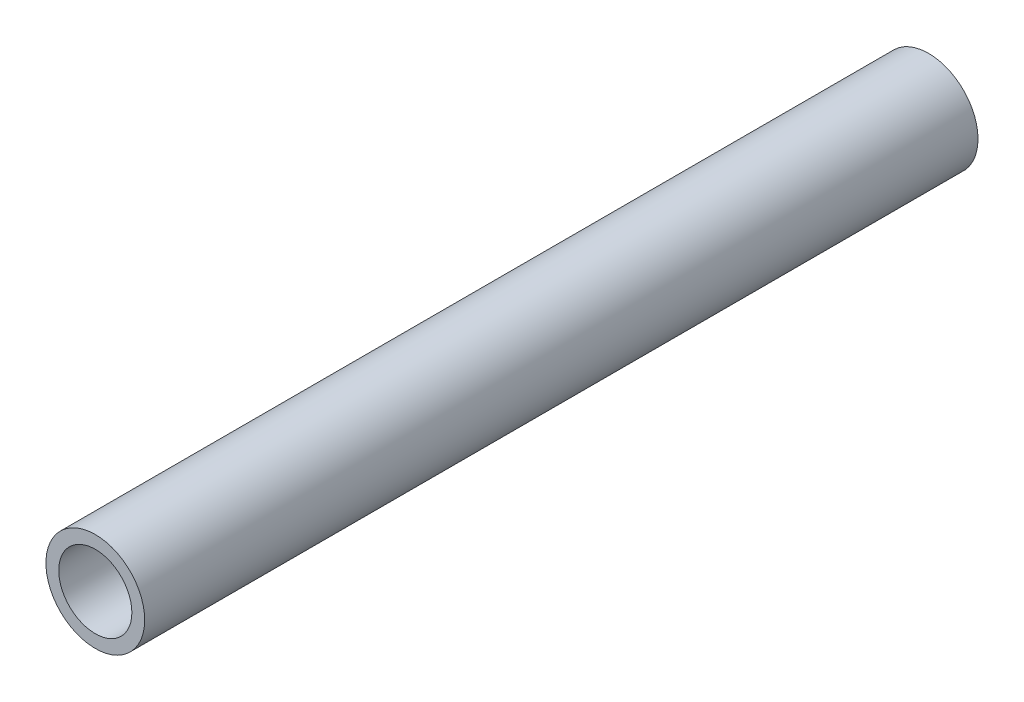
ISO-10303-21;
HEADER;
FILE_DESCRIPTION(('STEP AP214'),'2;1');
FILE_NAME('part.step','',(''),(''),'','','');
FILE_SCHEMA(('AUTOMOTIVE_DESIGN { 1 0 10303 214 1 1 1 1 }'));
ENDSEC;
DATA;
#1=APPLICATION_CONTEXT('core data for automotive mechanical design processes');
#2=APPLICATION_PROTOCOL_DEFINITION('international standard','automotive_design',2000,#1);
#3=PRODUCT_CONTEXT('',#1,'mechanical');
#4=PRODUCT('Part','Part','',(#3));
#5=PRODUCT_RELATED_PRODUCT_CATEGORY('part','',(#4));
#6=PRODUCT_DEFINITION_FORMATION('','',#4);
#7=PRODUCT_DEFINITION_CONTEXT('part definition',#1,'design');
#8=PRODUCT_DEFINITION('design','',#6,#7);
#9=PRODUCT_DEFINITION_SHAPE('','',#8);
#10=(LENGTH_UNIT() NAMED_UNIT(*) SI_UNIT(.MILLI.,.METRE.));
#11=(NAMED_UNIT(*) PLANE_ANGLE_UNIT() SI_UNIT($,.RADIAN.));
#12=(NAMED_UNIT(*) SI_UNIT($,.STERADIAN.) SOLID_ANGLE_UNIT());
#13=UNCERTAINTY_MEASURE_WITH_UNIT(LENGTH_MEASURE(1.E-05),#10,'distance_accuracy_value','');
#14=(GEOMETRIC_REPRESENTATION_CONTEXT(3) GLOBAL_UNCERTAINTY_ASSIGNED_CONTEXT((#13)) GLOBAL_UNIT_ASSIGNED_CONTEXT((#10,
#11,#12)) REPRESENTATION_CONTEXT('',''));
#15=CARTESIAN_POINT('',(0.,0.,0.));
#16=DIRECTION('',(0.,0.,1.));
#17=DIRECTION('',(1.,0.,0.));
#18=AXIS2_PLACEMENT_3D('',#15,#16,#17);
#19=CARTESIAN_POINT('',(0.,0.,90.));
#20=DIRECTION('',(0.,0.,1.));
#21=DIRECTION('',(1.,0.,0.));
#22=AXIS2_PLACEMENT_3D('',#19,#20,#21);
#23=PLANE('',#22);
#24=CARTESIAN_POINT('',(0.,0.,90.));
#25=DIRECTION('',(0.,0.,1.));
#26=DIRECTION('',(1.,0.,0.));
#27=AXIS2_PLACEMENT_3D('',#24,#25,#26);
#28=CIRCLE('',#27,10.668);
#29=CARTESIAN_POINT('',(10.668,0.,90.));
#30=VERTEX_POINT('',#29);
#31=EDGE_CURVE('E11',#30,#30,#28,.T.);
#32=ORIENTED_EDGE('',*,*,#31,.T.);
#33=EDGE_LOOP('',(#32));
#34=FACE_BOUND('',#33,.T.);
#35=CARTESIAN_POINT('',(0.,0.,90.));
#36=DIRECTION('',(0.,0.,1.));
#37=DIRECTION('',(1.,0.,0.));
#38=AXIS2_PLACEMENT_3D('',#35,#36,#37);
#39=CIRCLE('',#38,7.8994);
#40=CARTESIAN_POINT('',(7.8994,0.,90.));
#41=VERTEX_POINT('',#40);
#42=EDGE_CURVE('E48',#41,#41,#39,.T.);
#43=ORIENTED_EDGE('',*,*,#42,.F.);
#44=EDGE_LOOP('',(#43));
#45=FACE_BOUND('',#44,.T.);
#46=ADVANCED_FACE('F37',(#34,#45),#23,.T.);
#47=CARTESIAN_POINT('',(0.,0.,-90.));
#48=DIRECTION('',(0.,0.,1.));
#49=DIRECTION('',(1.,0.,0.));
#50=AXIS2_PLACEMENT_3D('',#47,#48,#49);
#51=PLANE('',#50);
#52=CARTESIAN_POINT('',(0.,0.,-90.));
#53=DIRECTION('',(0.,0.,1.));
#54=DIRECTION('',(1.,0.,0.));
#55=AXIS2_PLACEMENT_3D('',#52,#53,#54);
#56=CIRCLE('',#55,10.668);
#57=CARTESIAN_POINT('',(10.668,0.,-90.));
#58=VERTEX_POINT('',#57);
#59=EDGE_CURVE('E41',#58,#58,#56,.T.);
#60=ORIENTED_EDGE('',*,*,#59,.F.);
#61=EDGE_LOOP('',(#60));
#62=FACE_BOUND('',#61,.T.);
#63=CARTESIAN_POINT('',(0.,0.,-90.));
#64=DIRECTION('',(0.,0.,1.));
#65=DIRECTION('',(1.,0.,0.));
#66=AXIS2_PLACEMENT_3D('',#63,#64,#65);
#67=CIRCLE('',#66,7.8994);
#68=CARTESIAN_POINT('',(7.8994,0.,-90.));
#69=VERTEX_POINT('',#68);
#70=EDGE_CURVE('E50',#69,#69,#67,.T.);
#71=ORIENTED_EDGE('',*,*,#70,.T.);
#72=EDGE_LOOP('',(#71));
#73=FACE_BOUND('',#72,.T.);
#74=ADVANCED_FACE('F60',(#62,#73),#51,.F.);
#75=CARTESIAN_POINT('',(0.,0.,90.));
#76=DIRECTION('',(0.,0.,-1.));
#77=DIRECTION('',(-1.,0.,0.));
#78=AXIS2_PLACEMENT_3D('',#75,#76,#77);
#79=CYLINDRICAL_SURFACE('',#78,10.668);
#80=ORIENTED_EDGE('',*,*,#31,.F.);
#81=EDGE_LOOP('',(#80));
#82=FACE_BOUND('',#81,.T.);
#83=ORIENTED_EDGE('',*,*,#59,.T.);
#84=EDGE_LOOP('',(#83));
#85=FACE_BOUND('',#84,.T.);
#86=ADVANCED_FACE('F39',(#82,#85),#79,.T.);
#87=CARTESIAN_POINT('',(0.,0.,90.));
#88=DIRECTION('',(0.,0.,-1.));
#89=DIRECTION('',(-1.,0.,0.));
#90=AXIS2_PLACEMENT_3D('',#87,#88,#89);
#91=CYLINDRICAL_SURFACE('',#90,7.8994);
#92=ORIENTED_EDGE('',*,*,#42,.T.);
#93=EDGE_LOOP('',(#92));
#94=FACE_BOUND('',#93,.T.);
#95=ORIENTED_EDGE('',*,*,#70,.F.);
#96=EDGE_LOOP('',(#95));
#97=FACE_BOUND('',#96,.T.);
#98=ADVANCED_FACE('F56',(#94,#97),#91,.F.);
#99=CLOSED_SHELL('',(#46,#74,#86,#98));
#100=MANIFOLD_SOLID_BREP('B2',#99);
#101=ADVANCED_BREP_SHAPE_REPRESENTATION('',(#18,#100),#14);
#102=SHAPE_DEFINITION_REPRESENTATION(#9,#101);
ENDSEC;
END-ISO-10303-21;
